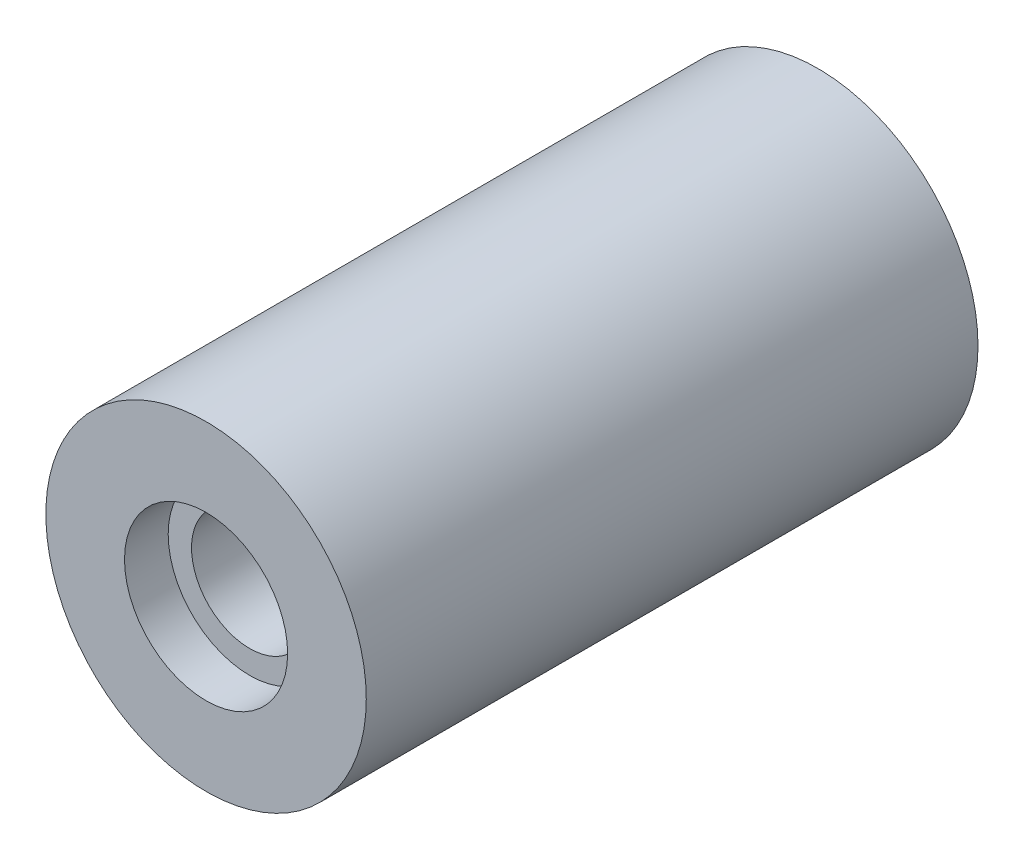
ISO-10303-21;
HEADER;
FILE_DESCRIPTION(('STEP AP214'),'2;1');
FILE_NAME('part.step','',(''),(''),'','','');
FILE_SCHEMA(('AUTOMOTIVE_DESIGN { 1 0 10303 214 1 1 1 1 }'));
ENDSEC;
DATA;
#1=APPLICATION_CONTEXT('core data for automotive mechanical design processes');
#2=APPLICATION_PROTOCOL_DEFINITION('international standard','automotive_design',2000,#1);
#3=PRODUCT_CONTEXT('',#1,'mechanical');
#4=PRODUCT('Part','Part','',(#3));
#5=PRODUCT_RELATED_PRODUCT_CATEGORY('part','',(#4));
#6=PRODUCT_DEFINITION_FORMATION('','',#4);
#7=PRODUCT_DEFINITION_CONTEXT('part definition',#1,'design');
#8=PRODUCT_DEFINITION('design','',#6,#7);
#9=PRODUCT_DEFINITION_SHAPE('','',#8);
#10=(LENGTH_UNIT() NAMED_UNIT(*) SI_UNIT(.MILLI.,.METRE.));
#11=(NAMED_UNIT(*) PLANE_ANGLE_UNIT() SI_UNIT($,.RADIAN.));
#12=(NAMED_UNIT(*) SI_UNIT($,.STERADIAN.) SOLID_ANGLE_UNIT());
#13=UNCERTAINTY_MEASURE_WITH_UNIT(LENGTH_MEASURE(1.E-05),#10,'distance_accuracy_value','');
#14=(GEOMETRIC_REPRESENTATION_CONTEXT(3) GLOBAL_UNCERTAINTY_ASSIGNED_CONTEXT((#13)) GLOBAL_UNIT_ASSIGNED_CONTEXT((#10,
#11,#12)) REPRESENTATION_CONTEXT('',''));
#15=CARTESIAN_POINT('',(0.,0.,0.));
#16=DIRECTION('',(0.,0.,1.));
#17=DIRECTION('',(1.,0.,0.));
#18=AXIS2_PLACEMENT_3D('',#15,#16,#17);
#19=CARTESIAN_POINT('',(100.,19.9999999999986,26.5));
#20=DIRECTION('',(0.,0.,1.));
#21=DIRECTION('',(1.,0.,0.));
#22=AXIS2_PLACEMENT_3D('',#19,#20,#21);
#23=CYLINDRICAL_SURFACE('',#22,2.8);
#24=CARTESIAN_POINT('',(100.,19.9999999999986,28.));
#25=DIRECTION('',(0.,0.,1.));
#26=DIRECTION('',(1.,0.,0.));
#27=AXIS2_PLACEMENT_3D('',#24,#25,#26);
#28=CIRCLE('',#27,2.8);
#29=CARTESIAN_POINT('',(102.8,19.9999999999986,28.));
#30=VERTEX_POINT('',#29);
#31=EDGE_CURVE('E27',#30,#30,#28,.T.);
#32=ORIENTED_EDGE('',*,*,#31,.T.);
#33=EDGE_LOOP('',(#32));
#34=FACE_BOUND('',#33,.T.);
#35=CARTESIAN_POINT('',(100.,19.9999999999986,26.5));
#36=DIRECTION('',(0.,0.,1.));
#37=DIRECTION('',(1.,0.,0.));
#38=AXIS2_PLACEMENT_3D('',#35,#36,#37);
#39=CIRCLE('',#38,2.8);
#40=CARTESIAN_POINT('',(102.8,19.9999999999986,26.5));
#41=VERTEX_POINT('',#40);
#42=EDGE_CURVE('E11',#41,#41,#39,.T.);
#43=ORIENTED_EDGE('',*,*,#42,.F.);
#44=EDGE_LOOP('',(#43));
#45=FACE_BOUND('',#44,.T.);
#46=ADVANCED_FACE('F17',(#34,#45),#23,.F.);
#47=CARTESIAN_POINT('',(100.,19.9999999999992,26.5));
#48=DIRECTION('',(0.,0.,1.));
#49=DIRECTION('',(1.,0.,0.));
#50=AXIS2_PLACEMENT_3D('',#47,#48,#49);
#51=PLANE('',#50);
#52=CARTESIAN_POINT('',(100.,19.9999999999986,26.5));
#53=DIRECTION('',(0.,0.,-1.));
#54=DIRECTION('',(1.,0.,0.));
#55=AXIS2_PLACEMENT_3D('',#52,#53,#54);
#56=CIRCLE('',#55,2.);
#57=CARTESIAN_POINT('',(102.,19.9999999999986,26.5));
#58=VERTEX_POINT('',#57);
#59=EDGE_CURVE('E61',#58,#58,#56,.T.);
#60=ORIENTED_EDGE('',*,*,#59,.T.);
#61=EDGE_LOOP('',(#60));
#62=FACE_BOUND('',#61,.T.);
#63=ORIENTED_EDGE('',*,*,#42,.T.);
#64=EDGE_LOOP('',(#63));
#65=FACE_BOUND('',#64,.T.);
#66=ADVANCED_FACE('F87',(#62,#65),#51,.T.);
#67=CARTESIAN_POINT('',(94.25,0.,28.));
#68=DIRECTION('',(0.,0.,1.));
#69=DIRECTION('',(1.,0.,0.));
#70=AXIS2_PLACEMENT_3D('',#67,#68,#69);
#71=PLANE('',#70);
#72=CARTESIAN_POINT('',(100.,19.9999999999992,28.));
#73=DIRECTION('',(0.,0.,1.));
#74=DIRECTION('',(1.,0.,0.));
#75=AXIS2_PLACEMENT_3D('',#72,#73,#74);
#76=CIRCLE('',#75,5.5000000000006);
#77=CARTESIAN_POINT('',(105.5,19.9999999999992,28.));
#78=VERTEX_POINT('',#77);
#79=EDGE_CURVE('E21',#78,#78,#76,.T.);
#80=ORIENTED_EDGE('',*,*,#79,.T.);
#81=EDGE_LOOP('',(#80));
#82=FACE_BOUND('',#81,.T.);
#83=ORIENTED_EDGE('',*,*,#31,.F.);
#84=EDGE_LOOP('',(#83));
#85=FACE_BOUND('',#84,.T.);
#86=ADVANCED_FACE('F92',(#82,#85),#71,.T.);
#87=CARTESIAN_POINT('',(100.,19.9999999999992,6.998));
#88=DIRECTION('',(0.,0.,1.));
#89=DIRECTION('',(1.,0.,0.));
#90=AXIS2_PLACEMENT_3D('',#87,#88,#89);
#91=CYLINDRICAL_SURFACE('',#90,5.5000000000006);
#92=ORIENTED_EDGE('',*,*,#79,.F.);
#93=EDGE_LOOP('',(#92));
#94=FACE_BOUND('',#93,.T.);
#95=CARTESIAN_POINT('',(100.,19.9999999999992,7.));
#96=DIRECTION('',(0.,0.,-1.));
#97=DIRECTION('',(1.,0.,0.));
#98=AXIS2_PLACEMENT_3D('',#95,#96,#97);
#99=CIRCLE('',#98,5.5000000000006);
#100=CARTESIAN_POINT('',(105.5,19.9999999999992,7.));
#101=VERTEX_POINT('',#100);
#102=EDGE_CURVE('E69',#101,#101,#99,.T.);
#103=ORIENTED_EDGE('',*,*,#102,.F.);
#104=EDGE_LOOP('',(#103));
#105=FACE_BOUND('',#104,.T.);
#106=ADVANCED_FACE('F101',(#94,#105),#91,.T.);
#107=CARTESIAN_POINT('',(94.25,0.,7.));
#108=DIRECTION('',(0.,0.,1.));
#109=DIRECTION('',(1.,0.,0.));
#110=AXIS2_PLACEMENT_3D('',#107,#108,#109);
#111=PLANE('',#110);
#112=CARTESIAN_POINT('',(100.,19.9999999999986,7.));
#113=DIRECTION('',(0.,0.,-1.));
#114=DIRECTION('',(1.,0.,0.));
#115=AXIS2_PLACEMENT_3D('',#112,#113,#114);
#116=CIRCLE('',#115,2.);
#117=CARTESIAN_POINT('',(102.,19.9999999999986,7.));
#118=VERTEX_POINT('',#117);
#119=EDGE_CURVE('E56',#118,#118,#116,.T.);
#120=ORIENTED_EDGE('',*,*,#119,.F.);
#121=EDGE_LOOP('',(#120));
#122=FACE_BOUND('',#121,.T.);
#123=ORIENTED_EDGE('',*,*,#102,.T.);
#124=EDGE_LOOP('',(#123));
#125=FACE_BOUND('',#124,.T.);
#126=ADVANCED_FACE('F70',(#122,#125),#111,.F.);
#127=CARTESIAN_POINT('',(100.,19.9999999999986,6.998));
#128=DIRECTION('',(0.,0.,1.));
#129=DIRECTION('',(1.,0.,0.));
#130=AXIS2_PLACEMENT_3D('',#127,#128,#129);
#131=CYLINDRICAL_SURFACE('',#130,2.);
#132=ORIENTED_EDGE('',*,*,#59,.F.);
#133=EDGE_LOOP('',(#132));
#134=FACE_BOUND('',#133,.T.);
#135=ORIENTED_EDGE('',*,*,#119,.T.);
#136=EDGE_LOOP('',(#135));
#137=FACE_BOUND('',#136,.T.);
#138=ADVANCED_FACE('F19',(#134,#137),#131,.F.);
#139=CLOSED_SHELL('',(#46,#66,#86,#106,#126,#138));
#140=MANIFOLD_SOLID_BREP('B1',#139);
#141=ADVANCED_BREP_SHAPE_REPRESENTATION('',(#18,#140),#14);
#142=SHAPE_DEFINITION_REPRESENTATION(#9,#141);
ENDSEC;
END-ISO-10303-21;
